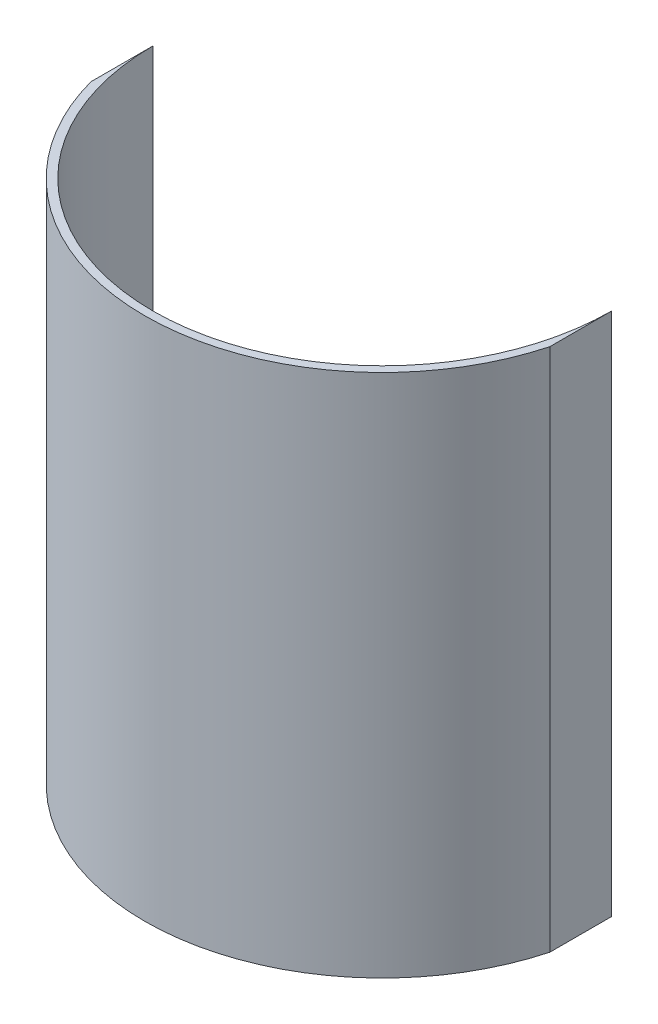
ISO-10303-21;
HEADER;
FILE_DESCRIPTION(('STEP AP214'),'2;1');
FILE_NAME('part.step','',(''),(''),'','','');
FILE_SCHEMA(('AUTOMOTIVE_DESIGN { 1 0 10303 214 1 1 1 1 }'));
ENDSEC;
DATA;
#1=APPLICATION_CONTEXT('core data for automotive mechanical design processes');
#2=APPLICATION_PROTOCOL_DEFINITION('international standard','automotive_design',2000,#1);
#3=PRODUCT_CONTEXT('',#1,'mechanical');
#4=PRODUCT('Part','Part','',(#3));
#5=PRODUCT_RELATED_PRODUCT_CATEGORY('part','',(#4));
#6=PRODUCT_DEFINITION_FORMATION('','',#4);
#7=PRODUCT_DEFINITION_CONTEXT('part definition',#1,'design');
#8=PRODUCT_DEFINITION('design','',#6,#7);
#9=PRODUCT_DEFINITION_SHAPE('','',#8);
#10=(LENGTH_UNIT() NAMED_UNIT(*) SI_UNIT(.MILLI.,.METRE.));
#11=(NAMED_UNIT(*) PLANE_ANGLE_UNIT() SI_UNIT($,.RADIAN.));
#12=(NAMED_UNIT(*) SI_UNIT($,.STERADIAN.) SOLID_ANGLE_UNIT());
#13=UNCERTAINTY_MEASURE_WITH_UNIT(LENGTH_MEASURE(1.E-05),#10,'distance_accuracy_value','');
#14=(GEOMETRIC_REPRESENTATION_CONTEXT(3) GLOBAL_UNCERTAINTY_ASSIGNED_CONTEXT((#13)) GLOBAL_UNIT_ASSIGNED_CONTEXT((#10,
#11,#12)) REPRESENTATION_CONTEXT('',''));
#15=CARTESIAN_POINT('',(0.,0.,0.));
#16=DIRECTION('',(0.,0.,1.));
#17=DIRECTION('',(1.,0.,0.));
#18=AXIS2_PLACEMENT_3D('',#15,#16,#17);
#19=CARTESIAN_POINT('',(0.,254.,0.));
#20=DIRECTION('',(0.,-1.,0.));
#21=DIRECTION('',(0.,0.,-1.));
#22=AXIS2_PLACEMENT_3D('',#19,#20,#21);
#23=CYLINDRICAL_SURFACE('',#22,92.0749999999999);
#24=CARTESIAN_POINT('',(0.,50.8,0.));
#25=DIRECTION('',(0.,1.,0.));
#26=DIRECTION('',(0.,0.,1.));
#27=AXIS2_PLACEMENT_3D('',#24,#25,#26);
#28=CIRCLE('',#27,92.0749999999999);
#29=CARTESIAN_POINT('',(-88.9,50.8,23.9707243319842));
#30=VERTEX_POINT('',#29);
#31=CARTESIAN_POINT('',(88.9,50.8,23.9707243319844));
#32=VERTEX_POINT('',#31);
#33=EDGE_CURVE('E96',#30,#32,#28,.T.);
#34=ORIENTED_EDGE('',*,*,#33,.T.);
#35=DIRECTION('',(0.,-1.,0.));
#36=VECTOR('',#35,1.);
#37=CARTESIAN_POINT('',(88.9,254.,23.9707243319844));
#38=LINE('',#37,#36);
#39=CARTESIAN_POINT('',(88.9,254.,23.9707243319844));
#40=VERTEX_POINT('',#39);
#41=EDGE_CURVE('E11',#40,#32,#38,.T.);
#42=ORIENTED_EDGE('',*,*,#41,.F.);
#43=CARTESIAN_POINT('',(0.,254.,0.));
#44=DIRECTION('',(0.,1.,0.));
#45=DIRECTION('',(0.,0.,1.));
#46=AXIS2_PLACEMENT_3D('',#43,#44,#45);
#47=CIRCLE('',#46,92.0749999999999);
#48=CARTESIAN_POINT('',(-88.9,254.,23.9707243319842));
#49=VERTEX_POINT('',#48);
#50=EDGE_CURVE('E84',#49,#40,#47,.T.);
#51=ORIENTED_EDGE('',*,*,#50,.F.);
#52=DIRECTION('',(0.,-1.,0.));
#53=VECTOR('',#52,1.);
#54=CARTESIAN_POINT('',(-88.9,254.,23.9707243319842));
#55=LINE('',#54,#53);
#56=EDGE_CURVE('E92',#49,#30,#55,.T.);
#57=ORIENTED_EDGE('',*,*,#56,.T.);
#58=EDGE_LOOP('',(#34,#42,#51,#57));
#59=FACE_BOUND('',#58,.T.);
#60=ADVANCED_FACE('F33',(#59),#23,.T.);
#61=CARTESIAN_POINT('',(88.9,254.,23.9707243319844));
#62=DIRECTION('',(-1.,0.,0.));
#63=DIRECTION('',(0.,0.,1.));
#64=AXIS2_PLACEMENT_3D('',#61,#62,#63);
#65=PLANE('',#64);
#66=DIRECTION('',(0.,0.,-1.));
#67=VECTOR('',#66,1.);
#68=CARTESIAN_POINT('',(88.9,50.8,23.9707243319844));
#69=LINE('',#68,#67);
#70=CARTESIAN_POINT('',(88.9,50.8,0.));
#71=VERTEX_POINT('',#70);
#72=EDGE_CURVE('E88',#32,#71,#69,.T.);
#73=ORIENTED_EDGE('',*,*,#72,.T.);
#74=DIRECTION('',(0.,-1.,0.));
#75=VECTOR('',#74,1.);
#76=CARTESIAN_POINT('',(88.9,254.,0.));
#77=LINE('',#76,#75);
#78=CARTESIAN_POINT('',(88.9,254.,0.));
#79=VERTEX_POINT('',#78);
#80=EDGE_CURVE('E41',#79,#71,#77,.T.);
#81=ORIENTED_EDGE('',*,*,#80,.F.);
#82=DIRECTION('',(0.,0.,-1.));
#83=VECTOR('',#82,1.);
#84=CARTESIAN_POINT('',(88.9,254.,23.9707243319844));
#85=LINE('',#84,#83);
#86=EDGE_CURVE('E79',#40,#79,#85,.T.);
#87=ORIENTED_EDGE('',*,*,#86,.F.);
#88=ORIENTED_EDGE('',*,*,#41,.T.);
#89=EDGE_LOOP('',(#73,#81,#87,#88));
#90=FACE_BOUND('',#89,.T.);
#91=ADVANCED_FACE('F87',(#90),#65,.F.);
#92=CARTESIAN_POINT('',(0.,254.,0.));
#93=DIRECTION('',(0.,-1.,0.));
#94=DIRECTION('',(0.,0.,-1.));
#95=AXIS2_PLACEMENT_3D('',#92,#93,#94);
#96=CYLINDRICAL_SURFACE('',#95,88.9);
#97=CARTESIAN_POINT('',(0.,50.8,0.));
#98=DIRECTION('',(0.,-1.,0.));
#99=DIRECTION('',(0.,0.,1.));
#100=AXIS2_PLACEMENT_3D('',#97,#98,#99);
#101=CIRCLE('',#100,88.9);
#102=CARTESIAN_POINT('',(-88.9000000000001,50.8,0.));
#103=VERTEX_POINT('',#102);
#104=EDGE_CURVE('E66',#71,#103,#101,.T.);
#105=ORIENTED_EDGE('',*,*,#104,.T.);
#106=DIRECTION('',(0.,-1.,0.));
#107=VECTOR('',#106,1.);
#108=CARTESIAN_POINT('',(-88.9000000000001,254.,0.));
#109=LINE('',#108,#107);
#110=CARTESIAN_POINT('',(-88.9000000000001,254.,0.));
#111=VERTEX_POINT('',#110);
#112=EDGE_CURVE('E89',#111,#103,#109,.T.);
#113=ORIENTED_EDGE('',*,*,#112,.F.);
#114=CARTESIAN_POINT('',(0.,254.,0.));
#115=DIRECTION('',(0.,-1.,0.));
#116=DIRECTION('',(0.,0.,1.));
#117=AXIS2_PLACEMENT_3D('',#114,#115,#116);
#118=CIRCLE('',#117,88.9);
#119=EDGE_CURVE('E82',#79,#111,#118,.T.);
#120=ORIENTED_EDGE('',*,*,#119,.F.);
#121=ORIENTED_EDGE('',*,*,#80,.T.);
#122=EDGE_LOOP('',(#105,#113,#120,#121));
#123=FACE_BOUND('',#122,.T.);
#124=ADVANCED_FACE('F90',(#123),#96,.F.);
#125=CARTESIAN_POINT('',(-88.9000000000001,254.,0.));
#126=DIRECTION('',(1.,0.,0.));
#127=DIRECTION('',(0.,0.,-1.));
#128=AXIS2_PLACEMENT_3D('',#125,#126,#127);
#129=PLANE('',#128);
#130=DIRECTION('',(0.,0.,1.));
#131=VECTOR('',#130,1.);
#132=CARTESIAN_POINT('',(-88.9000000000001,50.8,0.));
#133=LINE('',#132,#131);
#134=EDGE_CURVE('E72',#103,#30,#133,.T.);
#135=ORIENTED_EDGE('',*,*,#134,.T.);
#136=ORIENTED_EDGE('',*,*,#56,.F.);
#137=DIRECTION('',(0.,0.,1.));
#138=VECTOR('',#137,1.);
#139=CARTESIAN_POINT('',(-88.9000000000001,254.,0.));
#140=LINE('',#139,#138);
#141=EDGE_CURVE('E49',#111,#49,#140,.T.);
#142=ORIENTED_EDGE('',*,*,#141,.F.);
#143=ORIENTED_EDGE('',*,*,#112,.T.);
#144=EDGE_LOOP('',(#135,#136,#142,#143));
#145=FACE_BOUND('',#144,.T.);
#146=ADVANCED_FACE('F103',(#145),#129,.F.);
#147=CARTESIAN_POINT('',(0.,254.,0.));
#148=DIRECTION('',(0.,1.,0.));
#149=DIRECTION('',(0.,0.,1.));
#150=AXIS2_PLACEMENT_3D('',#147,#148,#149);
#151=PLANE('',#150);
#152=ORIENTED_EDGE('',*,*,#50,.T.);
#153=ORIENTED_EDGE('',*,*,#86,.T.);
#154=ORIENTED_EDGE('',*,*,#119,.T.);
#155=ORIENTED_EDGE('',*,*,#141,.T.);
#156=EDGE_LOOP('',(#152,#153,#154,#155));
#157=FACE_BOUND('',#156,.T.);
#158=ADVANCED_FACE('F80',(#157),#151,.T.);
#159=CARTESIAN_POINT('',(0.,50.8,0.));
#160=DIRECTION('',(0.,1.,0.));
#161=DIRECTION('',(0.,0.,1.));
#162=AXIS2_PLACEMENT_3D('',#159,#160,#161);
#163=PLANE('',#162);
#164=ORIENTED_EDGE('',*,*,#33,.F.);
#165=ORIENTED_EDGE('',*,*,#134,.F.);
#166=ORIENTED_EDGE('',*,*,#104,.F.);
#167=ORIENTED_EDGE('',*,*,#72,.F.);
#168=EDGE_LOOP('',(#164,#165,#166,#167));
#169=FACE_BOUND('',#168,.T.);
#170=ADVANCED_FACE('F106',(#169),#163,.F.);
#171=CLOSED_SHELL('',(#60,#91,#124,#146,#158,#170));
#172=MANIFOLD_SOLID_BREP('B2',#171);
#173=ADVANCED_BREP_SHAPE_REPRESENTATION('',(#18,#172),#14);
#174=SHAPE_DEFINITION_REPRESENTATION(#9,#173);
ENDSEC;
END-ISO-10303-21;
